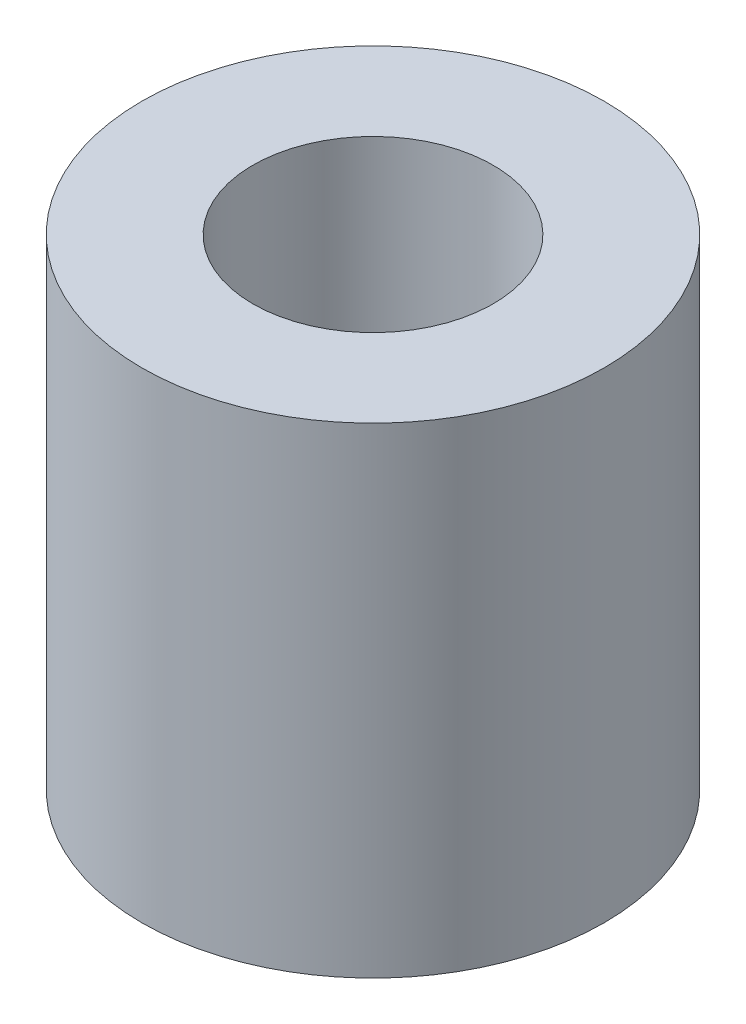
ISO-10303-21;
HEADER;
FILE_DESCRIPTION(('STEP AP214'),'2;1');
FILE_NAME('part.step','',(''),(''),'','','');
FILE_SCHEMA(('AUTOMOTIVE_DESIGN { 1 0 10303 214 1 1 1 1 }'));
ENDSEC;
DATA;
#1=APPLICATION_CONTEXT('core data for automotive mechanical design processes');
#2=APPLICATION_PROTOCOL_DEFINITION('international standard','automotive_design',2000,#1);
#3=PRODUCT_CONTEXT('',#1,'mechanical');
#4=PRODUCT('Part','Part','',(#3));
#5=PRODUCT_RELATED_PRODUCT_CATEGORY('part','',(#4));
#6=PRODUCT_DEFINITION_FORMATION('','',#4);
#7=PRODUCT_DEFINITION_CONTEXT('part definition',#1,'design');
#8=PRODUCT_DEFINITION('design','',#6,#7);
#9=PRODUCT_DEFINITION_SHAPE('','',#8);
#10=(LENGTH_UNIT() NAMED_UNIT(*) SI_UNIT(.MILLI.,.METRE.));
#11=(NAMED_UNIT(*) PLANE_ANGLE_UNIT() SI_UNIT($,.RADIAN.));
#12=(NAMED_UNIT(*) SI_UNIT($,.STERADIAN.) SOLID_ANGLE_UNIT());
#13=UNCERTAINTY_MEASURE_WITH_UNIT(LENGTH_MEASURE(1.E-05),#10,'distance_accuracy_value','');
#14=(GEOMETRIC_REPRESENTATION_CONTEXT(3) GLOBAL_UNCERTAINTY_ASSIGNED_CONTEXT((#13)) GLOBAL_UNIT_ASSIGNED_CONTEXT((#10,
#11,#12)) REPRESENTATION_CONTEXT('',''));
#15=CARTESIAN_POINT('',(0.,0.,0.));
#16=DIRECTION('',(0.,0.,1.));
#17=DIRECTION('',(1.,0.,0.));
#18=AXIS2_PLACEMENT_3D('',#15,#16,#17);
#19=CARTESIAN_POINT('',(0.,26.,0.));
#20=DIRECTION('',(0.,1.,0.));
#21=DIRECTION('',(0.,0.,1.));
#22=AXIS2_PLACEMENT_3D('',#19,#20,#21);
#23=PLANE('',#22);
#24=CARTESIAN_POINT('',(0.,26.,0.));
#25=DIRECTION('',(0.,1.,0.));
#26=DIRECTION('',(0.,0.,1.));
#27=AXIS2_PLACEMENT_3D('',#24,#25,#26);
#28=CIRCLE('',#27,12.5);
#29=CARTESIAN_POINT('',(0.,26.,12.5));
#30=VERTEX_POINT('',#29);
#31=EDGE_CURVE('E10',#30,#30,#28,.T.);
#32=ORIENTED_EDGE('',*,*,#31,.T.);
#33=EDGE_LOOP('',(#32));
#34=FACE_BOUND('',#33,.T.);
#35=CARTESIAN_POINT('',(0.,26.,0.));
#36=DIRECTION('',(0.,1.,0.));
#37=DIRECTION('',(0.,0.,1.));
#38=AXIS2_PLACEMENT_3D('',#35,#36,#37);
#39=CIRCLE('',#38,6.5);
#40=CARTESIAN_POINT('',(0.,26.,6.5));
#41=VERTEX_POINT('',#40);
#42=EDGE_CURVE('E40',#41,#41,#39,.T.);
#43=ORIENTED_EDGE('',*,*,#42,.F.);
#44=EDGE_LOOP('',(#43));
#45=FACE_BOUND('',#44,.T.);
#46=ADVANCED_FACE('F29',(#34,#45),#23,.T.);
#47=CARTESIAN_POINT('',(0.,0.,0.));
#48=DIRECTION('',(0.,1.,0.));
#49=DIRECTION('',(0.,0.,1.));
#50=AXIS2_PLACEMENT_3D('',#47,#48,#49);
#51=PLANE('',#50);
#52=CARTESIAN_POINT('',(0.,0.,0.));
#53=DIRECTION('',(0.,1.,0.));
#54=DIRECTION('',(0.,0.,1.));
#55=AXIS2_PLACEMENT_3D('',#52,#53,#54);
#56=CIRCLE('',#55,12.5);
#57=CARTESIAN_POINT('',(0.,0.,12.5));
#58=VERTEX_POINT('',#57);
#59=EDGE_CURVE('E33',#58,#58,#56,.T.);
#60=ORIENTED_EDGE('',*,*,#59,.F.);
#61=EDGE_LOOP('',(#60));
#62=FACE_BOUND('',#61,.T.);
#63=CARTESIAN_POINT('',(0.,0.,0.));
#64=DIRECTION('',(0.,1.,0.));
#65=DIRECTION('',(0.,0.,1.));
#66=AXIS2_PLACEMENT_3D('',#63,#64,#65);
#67=CIRCLE('',#66,6.5);
#68=CARTESIAN_POINT('',(0.,0.,6.5));
#69=VERTEX_POINT('',#68);
#70=EDGE_CURVE('E42',#69,#69,#67,.T.);
#71=ORIENTED_EDGE('',*,*,#70,.T.);
#72=EDGE_LOOP('',(#71));
#73=FACE_BOUND('',#72,.T.);
#74=ADVANCED_FACE('F52',(#62,#73),#51,.F.);
#75=CARTESIAN_POINT('',(0.,26.,0.));
#76=DIRECTION('',(0.,-1.,0.));
#77=DIRECTION('',(0.,0.,-1.));
#78=AXIS2_PLACEMENT_3D('',#75,#76,#77);
#79=CYLINDRICAL_SURFACE('',#78,12.5);
#80=ORIENTED_EDGE('',*,*,#31,.F.);
#81=EDGE_LOOP('',(#80));
#82=FACE_BOUND('',#81,.T.);
#83=ORIENTED_EDGE('',*,*,#59,.T.);
#84=EDGE_LOOP('',(#83));
#85=FACE_BOUND('',#84,.T.);
#86=ADVANCED_FACE('F31',(#82,#85),#79,.T.);
#87=CARTESIAN_POINT('',(0.,26.,0.));
#88=DIRECTION('',(0.,-1.,0.));
#89=DIRECTION('',(0.,0.,-1.));
#90=AXIS2_PLACEMENT_3D('',#87,#88,#89);
#91=CYLINDRICAL_SURFACE('',#90,6.5);
#92=ORIENTED_EDGE('',*,*,#42,.T.);
#93=EDGE_LOOP('',(#92));
#94=FACE_BOUND('',#93,.T.);
#95=ORIENTED_EDGE('',*,*,#70,.F.);
#96=EDGE_LOOP('',(#95));
#97=FACE_BOUND('',#96,.T.);
#98=ADVANCED_FACE('F48',(#94,#97),#91,.F.);
#99=CLOSED_SHELL('',(#46,#74,#86,#98));
#100=MANIFOLD_SOLID_BREP('B2',#99);
#101=ADVANCED_BREP_SHAPE_REPRESENTATION('',(#18,#100),#14);
#102=SHAPE_DEFINITION_REPRESENTATION(#9,#101);
ENDSEC;
END-ISO-10303-21;
